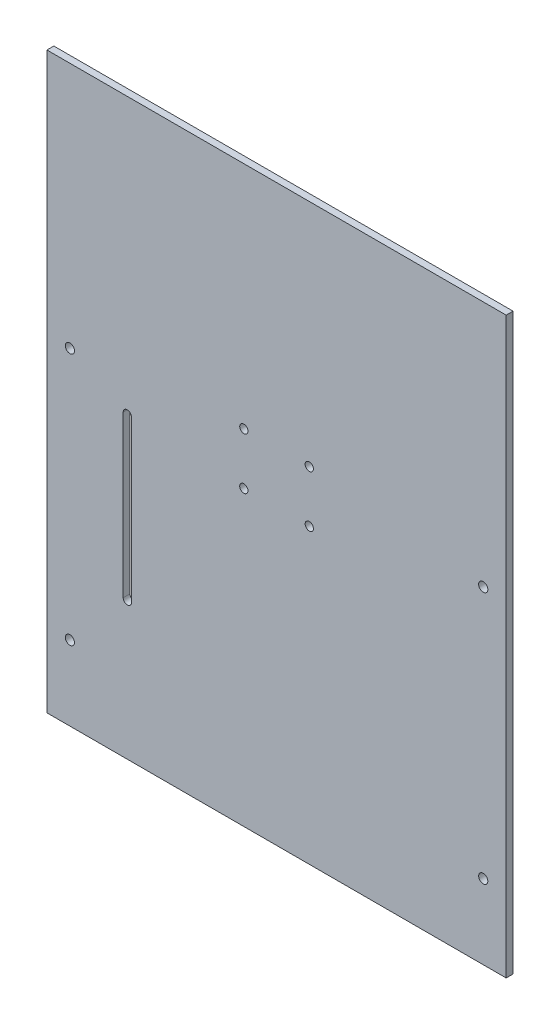
ISO-10303-21;
HEADER;
FILE_DESCRIPTION(('STEP AP214'),'2;1');
FILE_NAME('part.step','',(''),(''),'','','');
FILE_SCHEMA(('AUTOMOTIVE_DESIGN { 1 0 10303 214 1 1 1 1 }'));
ENDSEC;
DATA;
#1=APPLICATION_CONTEXT('core data for automotive mechanical design processes');
#2=APPLICATION_PROTOCOL_DEFINITION('international standard','automotive_design',2000,#1);
#3=PRODUCT_CONTEXT('',#1,'mechanical');
#4=PRODUCT('Part','Part','',(#3));
#5=PRODUCT_RELATED_PRODUCT_CATEGORY('part','',(#4));
#6=PRODUCT_DEFINITION_FORMATION('','',#4);
#7=PRODUCT_DEFINITION_CONTEXT('part definition',#1,'design');
#8=PRODUCT_DEFINITION('design','',#6,#7);
#9=PRODUCT_DEFINITION_SHAPE('','',#8);
#10=(LENGTH_UNIT() NAMED_UNIT(*) SI_UNIT(.MILLI.,.METRE.));
#11=(NAMED_UNIT(*) PLANE_ANGLE_UNIT() SI_UNIT($,.RADIAN.));
#12=(NAMED_UNIT(*) SI_UNIT($,.STERADIAN.) SOLID_ANGLE_UNIT());
#13=UNCERTAINTY_MEASURE_WITH_UNIT(LENGTH_MEASURE(1.E-05),#10,'distance_accuracy_value','');
#14=(GEOMETRIC_REPRESENTATION_CONTEXT(3) GLOBAL_UNCERTAINTY_ASSIGNED_CONTEXT((#13)) GLOBAL_UNIT_ASSIGNED_CONTEXT((#10,
#11,#12)) REPRESENTATION_CONTEXT('',''));
#15=CARTESIAN_POINT('',(0.,0.,0.));
#16=DIRECTION('',(0.,0.,1.));
#17=DIRECTION('',(1.,0.,0.));
#18=AXIS2_PLACEMENT_3D('',#15,#16,#17);
#19=CARTESIAN_POINT('',(0.,0.,3.));
#20=DIRECTION('',(0.,0.,-1.));
#21=DIRECTION('',(-1.,0.,0.));
#22=AXIS2_PLACEMENT_3D('',#19,#20,#21);
#23=PLANE('',#22);
#24=CARTESIAN_POINT('',(-90.,17.5000000000001,3.));
#25=DIRECTION('',(0.,0.,1.));
#26=DIRECTION('',(1.,0.,0.));
#27=AXIS2_PLACEMENT_3D('',#24,#25,#26);
#28=CIRCLE('',#27,2.);
#29=CARTESIAN_POINT('',(-88.,17.5000000000001,3.));
#30=VERTEX_POINT('',#29);
#31=EDGE_CURVE('E137',#30,#30,#28,.T.);
#32=ORIENTED_EDGE('',*,*,#31,.F.);
#33=EDGE_LOOP('',(#32));
#34=FACE_BOUND('',#33,.T.);
#35=CARTESIAN_POINT('',(-90.,-92.4999999999999,3.));
#36=DIRECTION('',(0.,0.,1.));
#37=DIRECTION('',(1.,0.,0.));
#38=AXIS2_PLACEMENT_3D('',#35,#36,#37);
#39=CIRCLE('',#38,2.);
#40=CARTESIAN_POINT('',(-88.,-92.4999999999999,3.));
#41=VERTEX_POINT('',#40);
#42=EDGE_CURVE('E143',#41,#41,#39,.T.);
#43=ORIENTED_EDGE('',*,*,#42,.F.);
#44=EDGE_LOOP('',(#43));
#45=FACE_BOUND('',#44,.T.);
#46=CARTESIAN_POINT('',(-14.25,2.50000000000008,3.));
#47=DIRECTION('',(0.,0.,1.));
#48=DIRECTION('',(1.,0.,0.));
#49=AXIS2_PLACEMENT_3D('',#46,#47,#48);
#50=CIRCLE('',#49,1.8);
#51=CARTESIAN_POINT('',(-12.45,2.50000000000008,3.));
#52=VERTEX_POINT('',#51);
#53=EDGE_CURVE('E149',#52,#52,#50,.T.);
#54=ORIENTED_EDGE('',*,*,#53,.F.);
#55=EDGE_LOOP('',(#54));
#56=FACE_BOUND('',#55,.T.);
#57=CARTESIAN_POINT('',(14.25,2.50000000000008,3.));
#58=DIRECTION('',(0.,0.,1.));
#59=DIRECTION('',(1.,0.,0.));
#60=AXIS2_PLACEMENT_3D('',#57,#58,#59);
#61=CIRCLE('',#60,1.8);
#62=CARTESIAN_POINT('',(16.05,2.50000000000008,3.));
#63=VERTEX_POINT('',#62);
#64=EDGE_CURVE('E155',#63,#63,#61,.T.);
#65=ORIENTED_EDGE('',*,*,#64,.F.);
#66=EDGE_LOOP('',(#65));
#67=FACE_BOUND('',#66,.T.);
#68=CARTESIAN_POINT('',(14.25,25.0000000000001,3.));
#69=DIRECTION('',(0.,0.,1.));
#70=DIRECTION('',(1.,0.,0.));
#71=AXIS2_PLACEMENT_3D('',#68,#69,#70);
#72=CIRCLE('',#71,1.8);
#73=CARTESIAN_POINT('',(16.05,25.0000000000001,3.));
#74=VERTEX_POINT('',#73);
#75=EDGE_CURVE('E161',#74,#74,#72,.T.);
#76=ORIENTED_EDGE('',*,*,#75,.F.);
#77=EDGE_LOOP('',(#76));
#78=FACE_BOUND('',#77,.T.);
#79=CARTESIAN_POINT('',(-14.25,25.0000000000001,3.));
#80=DIRECTION('',(0.,0.,1.));
#81=DIRECTION('',(1.,0.,0.));
#82=AXIS2_PLACEMENT_3D('',#79,#80,#81);
#83=CIRCLE('',#82,1.8);
#84=CARTESIAN_POINT('',(-12.45,25.0000000000001,3.));
#85=VERTEX_POINT('',#84);
#86=EDGE_CURVE('E167',#85,#85,#83,.T.);
#87=ORIENTED_EDGE('',*,*,#86,.F.);
#88=EDGE_LOOP('',(#87));
#89=FACE_BOUND('',#88,.T.);
#90=DIRECTION('',(1.,0.,0.));
#91=VECTOR('',#90,1.);
#92=CARTESIAN_POINT('',(-100.,-125.,3.));
#93=LINE('',#92,#91);
#94=CARTESIAN_POINT('',(-100.,-125.,3.));
#95=VERTEX_POINT('',#94);
#96=CARTESIAN_POINT('',(100.,-125.,3.));
#97=VERTEX_POINT('',#96);
#98=EDGE_CURVE('E173',#95,#97,#93,.T.);
#99=ORIENTED_EDGE('',*,*,#98,.T.);
#100=DIRECTION('',(0.,1.,0.));
#101=VECTOR('',#100,1.);
#102=CARTESIAN_POINT('',(100.,125.,3.));
#103=LINE('',#102,#101);
#104=CARTESIAN_POINT('',(100.,125.,3.));
#105=VERTEX_POINT('',#104);
#106=EDGE_CURVE('E176',#97,#105,#103,.T.);
#107=ORIENTED_EDGE('',*,*,#106,.T.);
#108=DIRECTION('',(-1.,0.,0.));
#109=VECTOR('',#108,1.);
#110=CARTESIAN_POINT('',(-100.,125.,3.));
#111=LINE('',#110,#109);
#112=CARTESIAN_POINT('',(-100.,125.,3.));
#113=VERTEX_POINT('',#112);
#114=EDGE_CURVE('E179',#105,#113,#111,.T.);
#115=ORIENTED_EDGE('',*,*,#114,.T.);
#116=DIRECTION('',(0.,-1.,0.));
#117=VECTOR('',#116,1.);
#118=CARTESIAN_POINT('',(-100.,125.,3.));
#119=LINE('',#118,#117);
#120=EDGE_CURVE('E181',#113,#95,#119,.T.);
#121=ORIENTED_EDGE('',*,*,#120,.T.);
#122=EDGE_LOOP('',(#99,#107,#115,#121));
#123=FACE_BOUND('',#122,.T.);
#124=CARTESIAN_POINT('',(-65.,5.00000000000009,3.));
#125=DIRECTION('',(0.,0.,1.));
#126=DIRECTION('',(1.,0.,0.));
#127=AXIS2_PLACEMENT_3D('',#124,#125,#126);
#128=CIRCLE('',#127,1.8);
#129=CARTESIAN_POINT('',(-63.2,5.00000000000009,3.));
#130=VERTEX_POINT('',#129);
#131=CARTESIAN_POINT('',(-66.8,5.00000000000009,3.));
#132=VERTEX_POINT('',#131);
#133=EDGE_CURVE('E98',#130,#132,#128,.T.);
#134=ORIENTED_EDGE('',*,*,#133,.F.);
#135=DIRECTION('',(0.,1.,0.));
#136=VECTOR('',#135,1.);
#137=CARTESIAN_POINT('',(-63.2,5.00000000000009,3.));
#138=LINE('',#137,#136);
#139=CARTESIAN_POINT('',(-63.2,-64.9999999999999,3.));
#140=VERTEX_POINT('',#139);
#141=EDGE_CURVE('E121',#140,#130,#138,.T.);
#142=ORIENTED_EDGE('',*,*,#141,.F.);
#143=CARTESIAN_POINT('',(-65.,-64.9999999999999,3.));
#144=DIRECTION('',(0.,0.,1.));
#145=DIRECTION('',(1.,0.,0.));
#146=AXIS2_PLACEMENT_3D('',#143,#144,#145);
#147=CIRCLE('',#146,1.8);
#148=CARTESIAN_POINT('',(-66.8,-64.9999999999999,3.));
#149=VERTEX_POINT('',#148);
#150=EDGE_CURVE('E119',#149,#140,#147,.T.);
#151=ORIENTED_EDGE('',*,*,#150,.F.);
#152=DIRECTION('',(0.,-1.,0.));
#153=VECTOR('',#152,1.);
#154=CARTESIAN_POINT('',(-66.8,5.00000000000009,3.));
#155=LINE('',#154,#153);
#156=EDGE_CURVE('E106',#132,#149,#155,.T.);
#157=ORIENTED_EDGE('',*,*,#156,.F.);
#158=EDGE_LOOP('',(#134,#142,#151,#157));
#159=FACE_BOUND('',#158,.T.);
#160=CARTESIAN_POINT('',(90.,17.5000000000001,3.));
#161=DIRECTION('',(0.,0.,1.));
#162=DIRECTION('',(-1.,0.,0.));
#163=AXIS2_PLACEMENT_3D('',#160,#161,#162);
#164=CIRCLE('',#163,2.);
#165=CARTESIAN_POINT('',(88.,17.5000000000001,3.));
#166=VERTEX_POINT('',#165);
#167=EDGE_CURVE('E127',#166,#166,#164,.T.);
#168=ORIENTED_EDGE('',*,*,#167,.F.);
#169=EDGE_LOOP('',(#168));
#170=FACE_BOUND('',#169,.T.);
#171=CARTESIAN_POINT('',(90.,-92.4999999999999,3.));
#172=DIRECTION('',(0.,0.,1.));
#173=DIRECTION('',(-1.,0.,0.));
#174=AXIS2_PLACEMENT_3D('',#171,#172,#173);
#175=CIRCLE('',#174,2.);
#176=CARTESIAN_POINT('',(88.,-92.4999999999999,3.));
#177=VERTEX_POINT('',#176);
#178=EDGE_CURVE('E295',#177,#177,#175,.T.);
#179=ORIENTED_EDGE('',*,*,#178,.F.);
#180=EDGE_LOOP('',(#179));
#181=FACE_BOUND('',#180,.T.);
#182=ADVANCED_FACE('F33',(#34,#45,#56,#67,#78,#89,#123,#159,#170,#181),#23,.F.);
#183=CARTESIAN_POINT('',(0.,0.,0.));
#184=DIRECTION('',(0.,0.,-1.));
#185=DIRECTION('',(-1.,0.,0.));
#186=AXIS2_PLACEMENT_3D('',#183,#184,#185);
#187=PLANE('',#186);
#188=CARTESIAN_POINT('',(90.,17.5000000000001,0.));
#189=DIRECTION('',(0.,0.,1.));
#190=DIRECTION('',(-1.,0.,0.));
#191=AXIS2_PLACEMENT_3D('',#188,#189,#190);
#192=CIRCLE('',#191,2.);
#193=CARTESIAN_POINT('',(88.,17.5000000000001,0.));
#194=VERTEX_POINT('',#193);
#195=EDGE_CURVE('E301',#194,#194,#192,.T.);
#196=ORIENTED_EDGE('',*,*,#195,.T.);
#197=EDGE_LOOP('',(#196));
#198=FACE_BOUND('',#197,.T.);
#199=CARTESIAN_POINT('',(-90.,-92.4999999999999,0.));
#200=DIRECTION('',(0.,0.,1.));
#201=DIRECTION('',(1.,0.,0.));
#202=AXIS2_PLACEMENT_3D('',#199,#200,#201);
#203=CIRCLE('',#202,2.);
#204=CARTESIAN_POINT('',(-88.,-92.4999999999999,0.));
#205=VERTEX_POINT('',#204);
#206=EDGE_CURVE('E140',#205,#205,#203,.T.);
#207=ORIENTED_EDGE('',*,*,#206,.T.);
#208=EDGE_LOOP('',(#207));
#209=FACE_BOUND('',#208,.T.);
#210=CARTESIAN_POINT('',(14.25,2.50000000000008,0.));
#211=DIRECTION('',(0.,0.,1.));
#212=DIRECTION('',(1.,0.,0.));
#213=AXIS2_PLACEMENT_3D('',#210,#211,#212);
#214=CIRCLE('',#213,1.8);
#215=CARTESIAN_POINT('',(16.05,2.50000000000008,0.));
#216=VERTEX_POINT('',#215);
#217=EDGE_CURVE('E152',#216,#216,#214,.T.);
#218=ORIENTED_EDGE('',*,*,#217,.T.);
#219=EDGE_LOOP('',(#218));
#220=FACE_BOUND('',#219,.T.);
#221=CARTESIAN_POINT('',(-14.25,25.0000000000001,0.));
#222=DIRECTION('',(0.,0.,1.));
#223=DIRECTION('',(1.,0.,0.));
#224=AXIS2_PLACEMENT_3D('',#221,#222,#223);
#225=CIRCLE('',#224,1.8);
#226=CARTESIAN_POINT('',(-12.45,25.0000000000001,0.));
#227=VERTEX_POINT('',#226);
#228=EDGE_CURVE('E164',#227,#227,#225,.T.);
#229=ORIENTED_EDGE('',*,*,#228,.T.);
#230=EDGE_LOOP('',(#229));
#231=FACE_BOUND('',#230,.T.);
#232=DIRECTION('',(1.,0.,0.));
#233=VECTOR('',#232,1.);
#234=CARTESIAN_POINT('',(-100.,-125.,0.));
#235=LINE('',#234,#233);
#236=CARTESIAN_POINT('',(-100.,-125.,0.));
#237=VERTEX_POINT('',#236);
#238=CARTESIAN_POINT('',(100.,-125.,0.));
#239=VERTEX_POINT('',#238);
#240=EDGE_CURVE('E170',#237,#239,#235,.T.);
#241=ORIENTED_EDGE('',*,*,#240,.F.);
#242=DIRECTION('',(0.,-1.,0.));
#243=VECTOR('',#242,1.);
#244=CARTESIAN_POINT('',(-100.,125.,0.));
#245=LINE('',#244,#243);
#246=CARTESIAN_POINT('',(-100.,125.,0.));
#247=VERTEX_POINT('',#246);
#248=EDGE_CURVE('E177',#247,#237,#245,.T.);
#249=ORIENTED_EDGE('',*,*,#248,.F.);
#250=DIRECTION('',(-1.,0.,0.));
#251=VECTOR('',#250,1.);
#252=CARTESIAN_POINT('',(-100.,125.,0.));
#253=LINE('',#252,#251);
#254=CARTESIAN_POINT('',(100.,125.,0.));
#255=VERTEX_POINT('',#254);
#256=EDGE_CURVE('E188',#255,#247,#253,.T.);
#257=ORIENTED_EDGE('',*,*,#256,.F.);
#258=DIRECTION('',(0.,1.,0.));
#259=VECTOR('',#258,1.);
#260=CARTESIAN_POINT('',(100.,125.,0.));
#261=LINE('',#260,#259);
#262=EDGE_CURVE('E186',#239,#255,#261,.T.);
#263=ORIENTED_EDGE('',*,*,#262,.F.);
#264=EDGE_LOOP('',(#241,#249,#257,#263));
#265=FACE_BOUND('',#264,.T.);
#266=CARTESIAN_POINT('',(14.25,25.0000000000001,0.));
#267=DIRECTION('',(0.,0.,1.));
#268=DIRECTION('',(1.,0.,0.));
#269=AXIS2_PLACEMENT_3D('',#266,#267,#268);
#270=CIRCLE('',#269,1.8);
#271=CARTESIAN_POINT('',(16.05,25.0000000000001,0.));
#272=VERTEX_POINT('',#271);
#273=EDGE_CURVE('E158',#272,#272,#270,.T.);
#274=ORIENTED_EDGE('',*,*,#273,.T.);
#275=EDGE_LOOP('',(#274));
#276=FACE_BOUND('',#275,.T.);
#277=CARTESIAN_POINT('',(-14.25,2.50000000000008,0.));
#278=DIRECTION('',(0.,0.,1.));
#279=DIRECTION('',(1.,0.,0.));
#280=AXIS2_PLACEMENT_3D('',#277,#278,#279);
#281=CIRCLE('',#280,1.8);
#282=CARTESIAN_POINT('',(-12.45,2.50000000000008,0.));
#283=VERTEX_POINT('',#282);
#284=EDGE_CURVE('E146',#283,#283,#281,.T.);
#285=ORIENTED_EDGE('',*,*,#284,.T.);
#286=EDGE_LOOP('',(#285));
#287=FACE_BOUND('',#286,.T.);
#288=CARTESIAN_POINT('',(-90.,17.5000000000001,0.));
#289=DIRECTION('',(0.,0.,1.));
#290=DIRECTION('',(1.,0.,0.));
#291=AXIS2_PLACEMENT_3D('',#288,#289,#290);
#292=CIRCLE('',#291,2.);
#293=CARTESIAN_POINT('',(-88.,17.5000000000001,0.));
#294=VERTEX_POINT('',#293);
#295=EDGE_CURVE('E114',#294,#294,#292,.T.);
#296=ORIENTED_EDGE('',*,*,#295,.T.);
#297=EDGE_LOOP('',(#296));
#298=FACE_BOUND('',#297,.T.);
#299=DIRECTION('',(0.,1.,0.));
#300=VECTOR('',#299,1.);
#301=CARTESIAN_POINT('',(-63.2,5.00000000000009,0.));
#302=LINE('',#301,#300);
#303=CARTESIAN_POINT('',(-63.2,-64.9999999999999,0.));
#304=VERTEX_POINT('',#303);
#305=CARTESIAN_POINT('',(-63.2,5.00000000000009,0.));
#306=VERTEX_POINT('',#305);
#307=EDGE_CURVE('E107',#304,#306,#302,.T.);
#308=ORIENTED_EDGE('',*,*,#307,.T.);
#309=CARTESIAN_POINT('',(-65.,5.00000000000009,0.));
#310=DIRECTION('',(0.,0.,1.));
#311=DIRECTION('',(1.,0.,0.));
#312=AXIS2_PLACEMENT_3D('',#309,#310,#311);
#313=CIRCLE('',#312,1.8);
#314=CARTESIAN_POINT('',(-66.8,5.00000000000009,0.));
#315=VERTEX_POINT('',#314);
#316=EDGE_CURVE('E56',#306,#315,#313,.T.);
#317=ORIENTED_EDGE('',*,*,#316,.T.);
#318=DIRECTION('',(0.,-1.,0.));
#319=VECTOR('',#318,1.);
#320=CARTESIAN_POINT('',(-66.8,5.00000000000009,0.));
#321=LINE('',#320,#319);
#322=CARTESIAN_POINT('',(-66.8,-64.9999999999999,0.));
#323=VERTEX_POINT('',#322);
#324=EDGE_CURVE('E113',#315,#323,#321,.T.);
#325=ORIENTED_EDGE('',*,*,#324,.T.);
#326=CARTESIAN_POINT('',(-65.,-64.9999999999999,0.));
#327=DIRECTION('',(0.,0.,1.));
#328=DIRECTION('',(1.,0.,0.));
#329=AXIS2_PLACEMENT_3D('',#326,#327,#328);
#330=CIRCLE('',#329,1.8);
#331=EDGE_CURVE('E129',#323,#304,#330,.T.);
#332=ORIENTED_EDGE('',*,*,#331,.T.);
#333=EDGE_LOOP('',(#308,#317,#325,#332));
#334=FACE_BOUND('',#333,.T.);
#335=CARTESIAN_POINT('',(90.,-92.4999999999999,0.));
#336=DIRECTION('',(0.,0.,1.));
#337=DIRECTION('',(-1.,0.,0.));
#338=AXIS2_PLACEMENT_3D('',#335,#336,#337);
#339=CIRCLE('',#338,2.);
#340=CARTESIAN_POINT('',(88.,-92.4999999999999,0.));
#341=VERTEX_POINT('',#340);
#342=EDGE_CURVE('E298',#341,#341,#339,.T.);
#343=ORIENTED_EDGE('',*,*,#342,.T.);
#344=EDGE_LOOP('',(#343));
#345=FACE_BOUND('',#344,.T.);
#346=ADVANCED_FACE('F206',(#198,#209,#220,#231,#265,#276,#287,#298,#334,#345),#187,.T.);
#347=CARTESIAN_POINT('',(-100.,-125.,3.));
#348=DIRECTION('',(0.,1.,0.));
#349=DIRECTION('',(0.,0.,1.));
#350=AXIS2_PLACEMENT_3D('',#347,#348,#349);
#351=PLANE('',#350);
#352=ORIENTED_EDGE('',*,*,#240,.T.);
#353=DIRECTION('',(0.,0.,-1.));
#354=VECTOR('',#353,1.);
#355=CARTESIAN_POINT('',(100.,-125.,3.));
#356=LINE('',#355,#354);
#357=EDGE_CURVE('E11',#97,#239,#356,.T.);
#358=ORIENTED_EDGE('',*,*,#357,.F.);
#359=ORIENTED_EDGE('',*,*,#98,.F.);
#360=DIRECTION('',(0.,0.,-1.));
#361=VECTOR('',#360,1.);
#362=CARTESIAN_POINT('',(-100.,-125.,3.));
#363=LINE('',#362,#361);
#364=EDGE_CURVE('E183',#95,#237,#363,.T.);
#365=ORIENTED_EDGE('',*,*,#364,.T.);
#366=EDGE_LOOP('',(#352,#358,#359,#365));
#367=FACE_BOUND('',#366,.T.);
#368=ADVANCED_FACE('F35',(#367),#351,.F.);
#369=CARTESIAN_POINT('',(100.,125.,3.));
#370=DIRECTION('',(-1.,0.,0.));
#371=DIRECTION('',(0.,-1.,0.));
#372=AXIS2_PLACEMENT_3D('',#369,#370,#371);
#373=PLANE('',#372);
#374=ORIENTED_EDGE('',*,*,#262,.T.);
#375=DIRECTION('',(0.,0.,-1.));
#376=VECTOR('',#375,1.);
#377=CARTESIAN_POINT('',(100.,125.,3.));
#378=LINE('',#377,#376);
#379=EDGE_CURVE('E41',#105,#255,#378,.T.);
#380=ORIENTED_EDGE('',*,*,#379,.F.);
#381=ORIENTED_EDGE('',*,*,#106,.F.);
#382=ORIENTED_EDGE('',*,*,#357,.T.);
#383=EDGE_LOOP('',(#374,#380,#381,#382));
#384=FACE_BOUND('',#383,.T.);
#385=ADVANCED_FACE('F216',(#384),#373,.F.);
#386=CARTESIAN_POINT('',(-100.,125.,3.));
#387=DIRECTION('',(0.,-1.,0.));
#388=DIRECTION('',(0.,0.,-1.));
#389=AXIS2_PLACEMENT_3D('',#386,#387,#388);
#390=PLANE('',#389);
#391=ORIENTED_EDGE('',*,*,#256,.T.);
#392=DIRECTION('',(0.,0.,-1.));
#393=VECTOR('',#392,1.);
#394=CARTESIAN_POINT('',(-100.,125.,3.));
#395=LINE('',#394,#393);
#396=EDGE_CURVE('E193',#113,#247,#395,.T.);
#397=ORIENTED_EDGE('',*,*,#396,.F.);
#398=ORIENTED_EDGE('',*,*,#114,.F.);
#399=ORIENTED_EDGE('',*,*,#379,.T.);
#400=EDGE_LOOP('',(#391,#397,#398,#399));
#401=FACE_BOUND('',#400,.T.);
#402=ADVANCED_FACE('F200',(#401),#390,.F.);
#403=CARTESIAN_POINT('',(-100.,125.,3.));
#404=DIRECTION('',(1.,0.,0.));
#405=DIRECTION('',(0.,1.,0.));
#406=AXIS2_PLACEMENT_3D('',#403,#404,#405);
#407=PLANE('',#406);
#408=ORIENTED_EDGE('',*,*,#248,.T.);
#409=ORIENTED_EDGE('',*,*,#364,.F.);
#410=ORIENTED_EDGE('',*,*,#120,.F.);
#411=ORIENTED_EDGE('',*,*,#396,.T.);
#412=EDGE_LOOP('',(#408,#409,#410,#411));
#413=FACE_BOUND('',#412,.T.);
#414=ADVANCED_FACE('F210',(#413),#407,.F.);
#415=CARTESIAN_POINT('',(-14.25,25.0000000000001,3.));
#416=DIRECTION('',(0.,0.,-1.));
#417=DIRECTION('',(-1.,0.,0.));
#418=AXIS2_PLACEMENT_3D('',#415,#416,#417);
#419=CYLINDRICAL_SURFACE('',#418,1.8);
#420=ORIENTED_EDGE('',*,*,#86,.T.);
#421=EDGE_LOOP('',(#420));
#422=FACE_BOUND('',#421,.T.);
#423=ORIENTED_EDGE('',*,*,#228,.F.);
#424=EDGE_LOOP('',(#423));
#425=FACE_BOUND('',#424,.T.);
#426=ADVANCED_FACE('F234',(#422,#425),#419,.F.);
#427=CARTESIAN_POINT('',(14.25,25.0000000000001,3.));
#428=DIRECTION('',(0.,0.,-1.));
#429=DIRECTION('',(-1.,0.,0.));
#430=AXIS2_PLACEMENT_3D('',#427,#428,#429);
#431=CYLINDRICAL_SURFACE('',#430,1.8);
#432=ORIENTED_EDGE('',*,*,#75,.T.);
#433=EDGE_LOOP('',(#432));
#434=FACE_BOUND('',#433,.T.);
#435=ORIENTED_EDGE('',*,*,#273,.F.);
#436=EDGE_LOOP('',(#435));
#437=FACE_BOUND('',#436,.T.);
#438=ADVANCED_FACE('F241',(#434,#437),#431,.F.);
#439=CARTESIAN_POINT('',(14.25,2.50000000000008,3.));
#440=DIRECTION('',(0.,0.,-1.));
#441=DIRECTION('',(-1.,0.,0.));
#442=AXIS2_PLACEMENT_3D('',#439,#440,#441);
#443=CYLINDRICAL_SURFACE('',#442,1.8);
#444=ORIENTED_EDGE('',*,*,#64,.T.);
#445=EDGE_LOOP('',(#444));
#446=FACE_BOUND('',#445,.T.);
#447=ORIENTED_EDGE('',*,*,#217,.F.);
#448=EDGE_LOOP('',(#447));
#449=FACE_BOUND('',#448,.T.);
#450=ADVANCED_FACE('F246',(#446,#449),#443,.F.);
#451=CARTESIAN_POINT('',(-14.25,2.50000000000008,3.));
#452=DIRECTION('',(0.,0.,-1.));
#453=DIRECTION('',(-1.,0.,0.));
#454=AXIS2_PLACEMENT_3D('',#451,#452,#453);
#455=CYLINDRICAL_SURFACE('',#454,1.8);
#456=ORIENTED_EDGE('',*,*,#53,.T.);
#457=EDGE_LOOP('',(#456));
#458=FACE_BOUND('',#457,.T.);
#459=ORIENTED_EDGE('',*,*,#284,.F.);
#460=EDGE_LOOP('',(#459));
#461=FACE_BOUND('',#460,.T.);
#462=ADVANCED_FACE('F256',(#458,#461),#455,.F.);
#463=CARTESIAN_POINT('',(-90.,-92.4999999999999,3.));
#464=DIRECTION('',(0.,0.,-1.));
#465=DIRECTION('',(-1.,0.,0.));
#466=AXIS2_PLACEMENT_3D('',#463,#464,#465);
#467=CYLINDRICAL_SURFACE('',#466,2.);
#468=ORIENTED_EDGE('',*,*,#42,.T.);
#469=EDGE_LOOP('',(#468));
#470=FACE_BOUND('',#469,.T.);
#471=ORIENTED_EDGE('',*,*,#206,.F.);
#472=EDGE_LOOP('',(#471));
#473=FACE_BOUND('',#472,.T.);
#474=ADVANCED_FACE('F263',(#470,#473),#467,.F.);
#475=CARTESIAN_POINT('',(-90.,17.5000000000001,3.));
#476=DIRECTION('',(0.,0.,-1.));
#477=DIRECTION('',(-1.,0.,0.));
#478=AXIS2_PLACEMENT_3D('',#475,#476,#477);
#479=CYLINDRICAL_SURFACE('',#478,2.);
#480=ORIENTED_EDGE('',*,*,#31,.T.);
#481=EDGE_LOOP('',(#480));
#482=FACE_BOUND('',#481,.T.);
#483=ORIENTED_EDGE('',*,*,#295,.F.);
#484=EDGE_LOOP('',(#483));
#485=FACE_BOUND('',#484,.T.);
#486=ADVANCED_FACE('F267',(#482,#485),#479,.F.);
#487=CARTESIAN_POINT('',(-65.,5.00000000000009,3.));
#488=DIRECTION('',(0.,0.,-1.));
#489=DIRECTION('',(-1.,0.,0.));
#490=AXIS2_PLACEMENT_3D('',#487,#488,#489);
#491=CYLINDRICAL_SURFACE('',#490,1.8);
#492=ORIENTED_EDGE('',*,*,#316,.F.);
#493=DIRECTION('',(0.,0.,-1.));
#494=VECTOR('',#493,1.);
#495=CARTESIAN_POINT('',(-63.2,5.00000000000009,3.));
#496=LINE('',#495,#494);
#497=EDGE_CURVE('E102',#130,#306,#496,.T.);
#498=ORIENTED_EDGE('',*,*,#497,.F.);
#499=ORIENTED_EDGE('',*,*,#133,.T.);
#500=DIRECTION('',(0.,0.,-1.));
#501=VECTOR('',#500,1.);
#502=CARTESIAN_POINT('',(-66.8,5.00000000000009,3.));
#503=LINE('',#502,#501);
#504=EDGE_CURVE('E101',#132,#315,#503,.T.);
#505=ORIENTED_EDGE('',*,*,#504,.T.);
#506=EDGE_LOOP('',(#492,#498,#499,#505));
#507=FACE_BOUND('',#506,.T.);
#508=ADVANCED_FACE('F100',(#507),#491,.F.);
#509=CARTESIAN_POINT('',(-66.8,5.00000000000009,3.));
#510=DIRECTION('',(1.,0.,0.));
#511=DIRECTION('',(0.,0.,-1.));
#512=AXIS2_PLACEMENT_3D('',#509,#510,#511);
#513=PLANE('',#512);
#514=ORIENTED_EDGE('',*,*,#324,.F.);
#515=ORIENTED_EDGE('',*,*,#504,.F.);
#516=ORIENTED_EDGE('',*,*,#156,.T.);
#517=DIRECTION('',(0.,0.,-1.));
#518=VECTOR('',#517,1.);
#519=CARTESIAN_POINT('',(-66.8,-64.9999999999999,3.));
#520=LINE('',#519,#518);
#521=EDGE_CURVE('E115',#149,#323,#520,.T.);
#522=ORIENTED_EDGE('',*,*,#521,.T.);
#523=EDGE_LOOP('',(#514,#515,#516,#522));
#524=FACE_BOUND('',#523,.T.);
#525=ADVANCED_FACE('F110',(#524),#513,.T.);
#526=CARTESIAN_POINT('',(-65.,-64.9999999999999,3.));
#527=DIRECTION('',(0.,0.,-1.));
#528=DIRECTION('',(-1.,0.,0.));
#529=AXIS2_PLACEMENT_3D('',#526,#527,#528);
#530=CYLINDRICAL_SURFACE('',#529,1.8);
#531=ORIENTED_EDGE('',*,*,#331,.F.);
#532=ORIENTED_EDGE('',*,*,#521,.F.);
#533=ORIENTED_EDGE('',*,*,#150,.T.);
#534=DIRECTION('',(0.,0.,-1.));
#535=VECTOR('',#534,1.);
#536=CARTESIAN_POINT('',(-63.2,-64.9999999999999,3.));
#537=LINE('',#536,#535);
#538=EDGE_CURVE('E48',#140,#304,#537,.T.);
#539=ORIENTED_EDGE('',*,*,#538,.T.);
#540=EDGE_LOOP('',(#531,#532,#533,#539));
#541=FACE_BOUND('',#540,.T.);
#542=ADVANCED_FACE('F276',(#541),#530,.F.);
#543=CARTESIAN_POINT('',(-63.2,5.00000000000009,3.));
#544=DIRECTION('',(-1.,0.,0.));
#545=DIRECTION('',(0.,0.,1.));
#546=AXIS2_PLACEMENT_3D('',#543,#544,#545);
#547=PLANE('',#546);
#548=ORIENTED_EDGE('',*,*,#307,.F.);
#549=ORIENTED_EDGE('',*,*,#538,.F.);
#550=ORIENTED_EDGE('',*,*,#141,.T.);
#551=ORIENTED_EDGE('',*,*,#497,.T.);
#552=EDGE_LOOP('',(#548,#549,#550,#551));
#553=FACE_BOUND('',#552,.T.);
#554=ADVANCED_FACE('F279',(#553),#547,.T.);
#555=CARTESIAN_POINT('',(90.,17.5000000000001,3.));
#556=DIRECTION('',(0.,0.,-1.));
#557=DIRECTION('',(-1.,0.,0.));
#558=AXIS2_PLACEMENT_3D('',#555,#556,#557);
#559=CYLINDRICAL_SURFACE('',#558,2.);
#560=ORIENTED_EDGE('',*,*,#167,.T.);
#561=EDGE_LOOP('',(#560));
#562=FACE_BOUND('',#561,.T.);
#563=ORIENTED_EDGE('',*,*,#195,.F.);
#564=EDGE_LOOP('',(#563));
#565=FACE_BOUND('',#564,.T.);
#566=ADVANCED_FACE('F283',(#562,#565),#559,.F.);
#567=CARTESIAN_POINT('',(90.,-92.4999999999999,3.));
#568=DIRECTION('',(0.,0.,-1.));
#569=DIRECTION('',(-1.,0.,0.));
#570=AXIS2_PLACEMENT_3D('',#567,#568,#569);
#571=CYLINDRICAL_SURFACE('',#570,2.);
#572=ORIENTED_EDGE('',*,*,#178,.T.);
#573=EDGE_LOOP('',(#572));
#574=FACE_BOUND('',#573,.T.);
#575=ORIENTED_EDGE('',*,*,#342,.F.);
#576=EDGE_LOOP('',(#575));
#577=FACE_BOUND('',#576,.T.);
#578=ADVANCED_FACE('F286',(#574,#577),#571,.F.);
#579=CLOSED_SHELL('',(#182,#346,#368,#385,#402,#414,#426,#438,#450,#462,#474,#486,#508,#525,
#542,#554,#566,#578));
#580=MANIFOLD_SOLID_BREP('B2',#579);
#581=ADVANCED_BREP_SHAPE_REPRESENTATION('',(#18,#580),#14);
#582=SHAPE_DEFINITION_REPRESENTATION(#9,#581);
ENDSEC;
END-ISO-10303-21;
